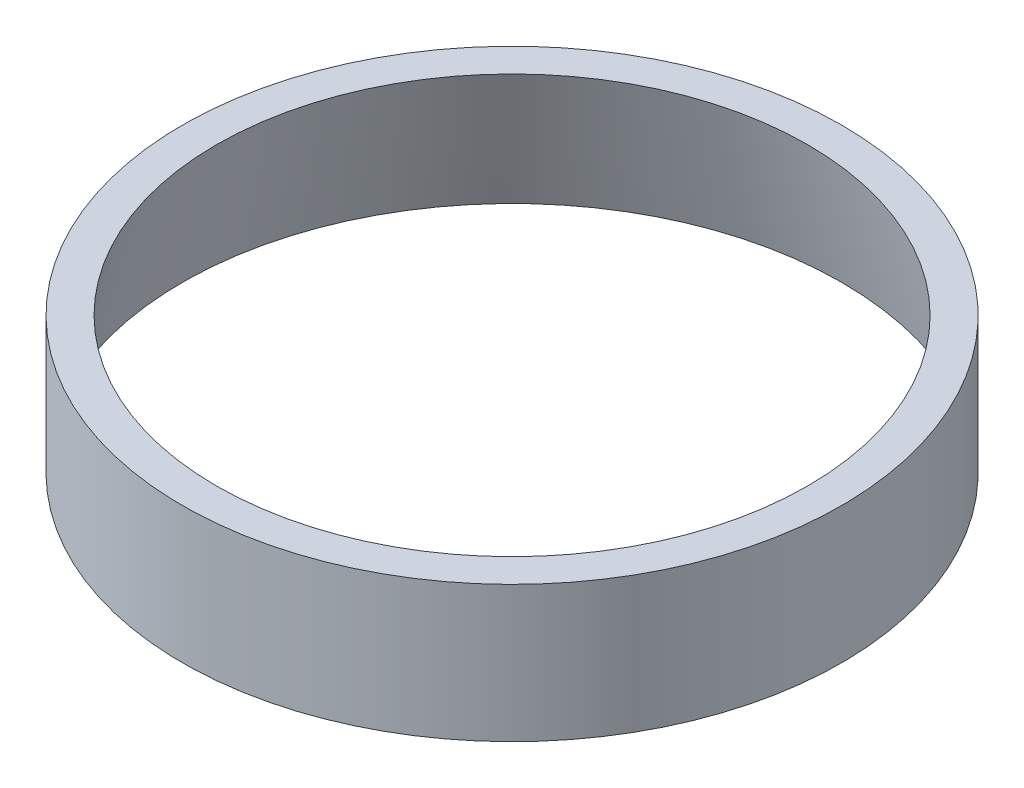
ISO-10303-21;
HEADER;
FILE_DESCRIPTION(('STEP AP214'),'2;1');
FILE_NAME('part.step','',(''),(''),'','','');
FILE_SCHEMA(('AUTOMOTIVE_DESIGN { 1 0 10303 214 1 1 1 1 }'));
ENDSEC;
DATA;
#1=APPLICATION_CONTEXT('core data for automotive mechanical design processes');
#2=APPLICATION_PROTOCOL_DEFINITION('international standard','automotive_design',2000,#1);
#3=PRODUCT_CONTEXT('',#1,'mechanical');
#4=PRODUCT('Part','Part','',(#3));
#5=PRODUCT_RELATED_PRODUCT_CATEGORY('part','',(#4));
#6=PRODUCT_DEFINITION_FORMATION('','',#4);
#7=PRODUCT_DEFINITION_CONTEXT('part definition',#1,'design');
#8=PRODUCT_DEFINITION('design','',#6,#7);
#9=PRODUCT_DEFINITION_SHAPE('','',#8);
#10=(LENGTH_UNIT() NAMED_UNIT(*) SI_UNIT(.MILLI.,.METRE.));
#11=(NAMED_UNIT(*) PLANE_ANGLE_UNIT() SI_UNIT($,.RADIAN.));
#12=(NAMED_UNIT(*) SI_UNIT($,.STERADIAN.) SOLID_ANGLE_UNIT());
#13=UNCERTAINTY_MEASURE_WITH_UNIT(LENGTH_MEASURE(1.E-05),#10,'distance_accuracy_value','');
#14=(GEOMETRIC_REPRESENTATION_CONTEXT(3) GLOBAL_UNCERTAINTY_ASSIGNED_CONTEXT((#13)) GLOBAL_UNIT_ASSIGNED_CONTEXT((#10,
#11,#12)) REPRESENTATION_CONTEXT('',''));
#15=CARTESIAN_POINT('',(0.,0.,0.));
#16=DIRECTION('',(0.,0.,1.));
#17=DIRECTION('',(1.,0.,0.));
#18=AXIS2_PLACEMENT_3D('',#15,#16,#17);
#19=CARTESIAN_POINT('',(0.,0.,0.));
#20=DIRECTION('',(0.,-1.,0.));
#21=DIRECTION('',(0.,0.,-1.));
#22=AXIS2_PLACEMENT_3D('',#19,#20,#21);
#23=CYLINDRICAL_SURFACE('',#22,37.5);
#24=CARTESIAN_POINT('',(0.,15.5,0.));
#25=DIRECTION('',(0.,-1.,0.));
#26=DIRECTION('',(0.,0.,-1.));
#27=AXIS2_PLACEMENT_3D('',#24,#25,#26);
#28=CIRCLE('',#27,37.5);
#29=CARTESIAN_POINT('',(0.,15.5,-37.5));
#30=VERTEX_POINT('',#29);
#31=EDGE_CURVE('E10',#30,#30,#28,.T.);
#32=ORIENTED_EDGE('',*,*,#31,.T.);
#33=EDGE_LOOP('',(#32));
#34=FACE_BOUND('',#33,.T.);
#35=CARTESIAN_POINT('',(0.,0.,0.));
#36=DIRECTION('',(0.,-1.,0.));
#37=DIRECTION('',(0.,0.,-1.));
#38=AXIS2_PLACEMENT_3D('',#35,#36,#37);
#39=CIRCLE('',#38,37.5);
#40=CARTESIAN_POINT('',(0.,0.,-37.5));
#41=VERTEX_POINT('',#40);
#42=EDGE_CURVE('E40',#41,#41,#39,.T.);
#43=ORIENTED_EDGE('',*,*,#42,.F.);
#44=EDGE_LOOP('',(#43));
#45=FACE_BOUND('',#44,.T.);
#46=ADVANCED_FACE('F30',(#34,#45),#23,.T.);
#47=CARTESIAN_POINT('',(33.6354159559306,15.5,0.));
#48=DIRECTION('',(0.,1.,0.));
#49=DIRECTION('',(0.,0.,1.));
#50=AXIS2_PLACEMENT_3D('',#47,#48,#49);
#51=PLANE('',#50);
#52=CARTESIAN_POINT('',(0.,15.5,0.));
#53=DIRECTION('',(0.,-1.,0.));
#54=DIRECTION('',(0.,0.,-1.));
#55=AXIS2_PLACEMENT_3D('',#52,#53,#54);
#56=CIRCLE('',#55,33.6354159559306);
#57=CARTESIAN_POINT('',(0.,15.5,-33.6354159559306));
#58=VERTEX_POINT('',#57);
#59=EDGE_CURVE('E36',#58,#58,#56,.T.);
#60=ORIENTED_EDGE('',*,*,#59,.T.);
#61=EDGE_LOOP('',(#60));
#62=FACE_BOUND('',#61,.T.);
#63=ORIENTED_EDGE('',*,*,#31,.F.);
#64=EDGE_LOOP('',(#63));
#65=FACE_BOUND('',#64,.T.);
#66=ADVANCED_FACE('F51',(#62,#65),#51,.T.);
#67=CARTESIAN_POINT('',(0.,15.5,0.));
#68=DIRECTION('',(0.,-1.,0.));
#69=DIRECTION('',(0.,0.,-1.));
#70=AXIS2_PLACEMENT_3D('',#67,#68,#69);
#71=CONICAL_SURFACE('',#70,33.6354159559306,0.244346095279209);
#72=ORIENTED_EDGE('',*,*,#42,.T.);
#73=EDGE_LOOP('',(#72));
#74=FACE_BOUND('',#73,.T.);
#75=ORIENTED_EDGE('',*,*,#59,.F.);
#76=EDGE_LOOP('',(#75));
#77=FACE_BOUND('',#76,.T.);
#78=ADVANCED_FACE('F47',(#74,#77),#71,.F.);
#79=CLOSED_SHELL('',(#46,#66,#78));
#80=MANIFOLD_SOLID_BREP('B2',#79);
#81=ADVANCED_BREP_SHAPE_REPRESENTATION('',(#18,#80),#14);
#82=SHAPE_DEFINITION_REPRESENTATION(#9,#81);
ENDSEC;
END-ISO-10303-21;
